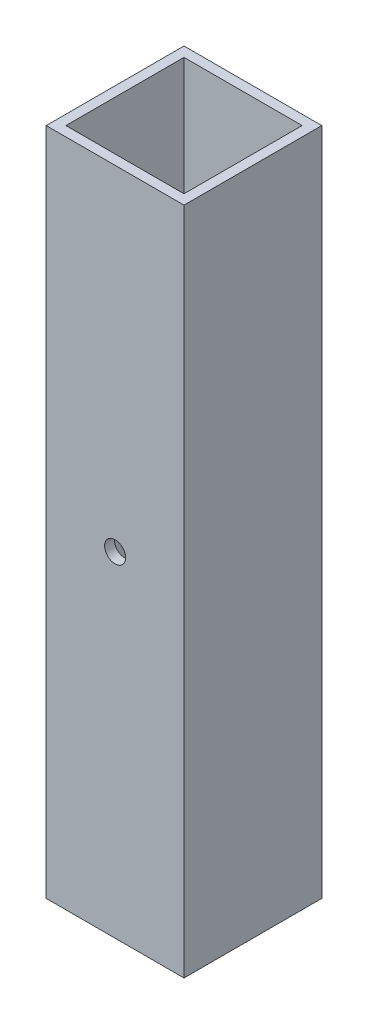
ISO-10303-21;
HEADER;
FILE_DESCRIPTION(('STEP AP214'),'2;1');
FILE_NAME('part.step','',(''),(''),'','','');
FILE_SCHEMA(('AUTOMOTIVE_DESIGN { 1 0 10303 214 1 1 1 1 }'));
ENDSEC;
DATA;
#1=APPLICATION_CONTEXT('core data for automotive mechanical design processes');
#2=APPLICATION_PROTOCOL_DEFINITION('international standard','automotive_design',2000,#1);
#3=PRODUCT_CONTEXT('',#1,'mechanical');
#4=PRODUCT('Part','Part','',(#3));
#5=PRODUCT_RELATED_PRODUCT_CATEGORY('part','',(#4));
#6=PRODUCT_DEFINITION_FORMATION('','',#4);
#7=PRODUCT_DEFINITION_CONTEXT('part definition',#1,'design');
#8=PRODUCT_DEFINITION('design','',#6,#7);
#9=PRODUCT_DEFINITION_SHAPE('','',#8);
#10=(LENGTH_UNIT() NAMED_UNIT(*) SI_UNIT(.MILLI.,.METRE.));
#11=(NAMED_UNIT(*) PLANE_ANGLE_UNIT() SI_UNIT($,.RADIAN.));
#12=(NAMED_UNIT(*) SI_UNIT($,.STERADIAN.) SOLID_ANGLE_UNIT());
#13=UNCERTAINTY_MEASURE_WITH_UNIT(LENGTH_MEASURE(1.E-05),#10,'distance_accuracy_value','');
#14=(GEOMETRIC_REPRESENTATION_CONTEXT(3) GLOBAL_UNCERTAINTY_ASSIGNED_CONTEXT((#13)) GLOBAL_UNIT_ASSIGNED_CONTEXT((#10,
#11,#12)) REPRESENTATION_CONTEXT('',''));
#15=CARTESIAN_POINT('',(0.,0.,0.));
#16=DIRECTION('',(0.,0.,1.));
#17=DIRECTION('',(1.,0.,0.));
#18=AXIS2_PLACEMENT_3D('',#15,#16,#17);
#19=CARTESIAN_POINT('',(22.225,260.35,-304.8));
#20=DIRECTION('',(0.,-1.,0.));
#21=DIRECTION('',(0.,0.,-1.));
#22=AXIS2_PLACEMENT_3D('',#19,#20,#21);
#23=PLANE('',#22);
#24=DIRECTION('',(1.,0.,0.));
#25=VECTOR('',#24,1.);
#26=CARTESIAN_POINT('',(22.225,260.35,-260.35));
#27=LINE('',#26,#25);
#28=CARTESIAN_POINT('',(0.,260.35,-260.35));
#29=VERTEX_POINT('',#28);
#30=CARTESIAN_POINT('',(44.45,260.35,-260.35));
#31=VERTEX_POINT('',#30);
#32=EDGE_CURVE('E170',#29,#31,#27,.T.);
#33=ORIENTED_EDGE('',*,*,#32,.T.);
#34=DIRECTION('',(0.,0.,1.));
#35=VECTOR('',#34,1.);
#36=CARTESIAN_POINT('',(44.45,260.35,-304.8));
#37=LINE('',#36,#35);
#38=CARTESIAN_POINT('',(44.45,260.35,-304.8));
#39=VERTEX_POINT('',#38);
#40=EDGE_CURVE('E179',#39,#31,#37,.T.);
#41=ORIENTED_EDGE('',*,*,#40,.F.);
#42=DIRECTION('',(1.,0.,0.));
#43=VECTOR('',#42,1.);
#44=CARTESIAN_POINT('',(22.225,260.35,-304.8));
#45=LINE('',#44,#43);
#46=CARTESIAN_POINT('',(0.,260.35,-304.8));
#47=VERTEX_POINT('',#46);
#48=EDGE_CURVE('E156',#47,#39,#45,.T.);
#49=ORIENTED_EDGE('',*,*,#48,.F.);
#50=DIRECTION('',(0.,0.,1.));
#51=VECTOR('',#50,1.);
#52=CARTESIAN_POINT('',(0.,260.35,-304.8));
#53=LINE('',#52,#51);
#54=EDGE_CURVE('E26',#47,#29,#53,.T.);
#55=ORIENTED_EDGE('',*,*,#54,.T.);
#56=EDGE_LOOP('',(#33,#41,#49,#55));
#57=FACE_BOUND('',#56,.T.);
#58=DIRECTION('',(1.,0.,0.));
#59=VECTOR('',#58,1.);
#60=CARTESIAN_POINT('',(22.225,260.35,-263.525));
#61=LINE('',#60,#59);
#62=CARTESIAN_POINT('',(3.175,260.35,-263.525));
#63=VERTEX_POINT('',#62);
#64=CARTESIAN_POINT('',(41.275,260.35,-263.525));
#65=VERTEX_POINT('',#64);
#66=EDGE_CURVE('E107',#63,#65,#61,.T.);
#67=ORIENTED_EDGE('',*,*,#66,.F.);
#68=DIRECTION('',(0.,0.,1.));
#69=VECTOR('',#68,1.);
#70=CARTESIAN_POINT('',(3.175,260.35,-304.8));
#71=LINE('',#70,#69);
#72=CARTESIAN_POINT('',(3.175,260.35,-301.625));
#73=VERTEX_POINT('',#72);
#74=EDGE_CURVE('E116',#73,#63,#71,.T.);
#75=ORIENTED_EDGE('',*,*,#74,.F.);
#76=DIRECTION('',(1.,0.,0.));
#77=VECTOR('',#76,1.);
#78=CARTESIAN_POINT('',(22.225,260.35,-301.625));
#79=LINE('',#78,#77);
#80=CARTESIAN_POINT('',(41.275,260.35,-301.625));
#81=VERTEX_POINT('',#80);
#82=EDGE_CURVE('E38',#73,#81,#79,.T.);
#83=ORIENTED_EDGE('',*,*,#82,.T.);
#84=DIRECTION('',(0.,0.,1.));
#85=VECTOR('',#84,1.);
#86=CARTESIAN_POINT('',(41.275,260.35,-304.8));
#87=LINE('',#86,#85);
#88=EDGE_CURVE('E122',#81,#65,#87,.T.);
#89=ORIENTED_EDGE('',*,*,#88,.T.);
#90=EDGE_LOOP('',(#67,#75,#83,#89));
#91=FACE_BOUND('',#90,.T.);
#92=ADVANCED_FACE('F16',(#57,#91),#23,.F.);
#93=CARTESIAN_POINT('',(22.225,44.45,-304.8));
#94=DIRECTION('',(0.,-1.,0.));
#95=DIRECTION('',(0.,0.,-1.));
#96=AXIS2_PLACEMENT_3D('',#93,#94,#95);
#97=PLANE('',#96);
#98=DIRECTION('',(1.,0.,0.));
#99=VECTOR('',#98,1.);
#100=CARTESIAN_POINT('',(22.225,44.45,-260.35));
#101=LINE('',#100,#99);
#102=CARTESIAN_POINT('',(0.,44.45,-260.35));
#103=VERTEX_POINT('',#102);
#104=CARTESIAN_POINT('',(44.45,44.45,-260.35));
#105=VERTEX_POINT('',#104);
#106=EDGE_CURVE('E141',#103,#105,#101,.T.);
#107=ORIENTED_EDGE('',*,*,#106,.F.);
#108=DIRECTION('',(0.,0.,1.));
#109=VECTOR('',#108,1.);
#110=CARTESIAN_POINT('',(0.,44.45,-304.8));
#111=LINE('',#110,#109);
#112=CARTESIAN_POINT('',(0.,44.45,-304.8));
#113=VERTEX_POINT('',#112);
#114=EDGE_CURVE('E11',#113,#103,#111,.T.);
#115=ORIENTED_EDGE('',*,*,#114,.F.);
#116=DIRECTION('',(1.,0.,0.));
#117=VECTOR('',#116,1.);
#118=CARTESIAN_POINT('',(22.225,44.45,-304.8));
#119=LINE('',#118,#117);
#120=CARTESIAN_POINT('',(44.45,44.45,-304.8));
#121=VERTEX_POINT('',#120);
#122=EDGE_CURVE('E148',#113,#121,#119,.T.);
#123=ORIENTED_EDGE('',*,*,#122,.T.);
#124=DIRECTION('',(0.,0.,1.));
#125=VECTOR('',#124,1.);
#126=CARTESIAN_POINT('',(44.45,44.45,-304.8));
#127=LINE('',#126,#125);
#128=EDGE_CURVE('E163',#121,#105,#127,.T.);
#129=ORIENTED_EDGE('',*,*,#128,.T.);
#130=EDGE_LOOP('',(#107,#115,#123,#129));
#131=FACE_BOUND('',#130,.T.);
#132=DIRECTION('',(0.,0.,1.));
#133=VECTOR('',#132,1.);
#134=CARTESIAN_POINT('',(3.175,44.45,-304.8));
#135=LINE('',#134,#133);
#136=CARTESIAN_POINT('',(3.175,44.45,-301.625));
#137=VERTEX_POINT('',#136);
#138=CARTESIAN_POINT('',(3.175,44.45,-263.525));
#139=VERTEX_POINT('',#138);
#140=EDGE_CURVE('E121',#137,#139,#135,.T.);
#141=ORIENTED_EDGE('',*,*,#140,.T.);
#142=DIRECTION('',(1.,0.,0.));
#143=VECTOR('',#142,1.);
#144=CARTESIAN_POINT('',(22.225,44.45,-263.525));
#145=LINE('',#144,#143);
#146=CARTESIAN_POINT('',(41.275,44.45,-263.525));
#147=VERTEX_POINT('',#146);
#148=EDGE_CURVE('E110',#139,#147,#145,.T.);
#149=ORIENTED_EDGE('',*,*,#148,.T.);
#150=DIRECTION('',(0.,0.,1.));
#151=VECTOR('',#150,1.);
#152=CARTESIAN_POINT('',(41.275,44.45,-304.8));
#153=LINE('',#152,#151);
#154=CARTESIAN_POINT('',(41.275,44.45,-301.625));
#155=VERTEX_POINT('',#154);
#156=EDGE_CURVE('E137',#155,#147,#153,.T.);
#157=ORIENTED_EDGE('',*,*,#156,.F.);
#158=DIRECTION('',(1.,0.,0.));
#159=VECTOR('',#158,1.);
#160=CARTESIAN_POINT('',(22.225,44.45,-301.625));
#161=LINE('',#160,#159);
#162=EDGE_CURVE('E132',#137,#155,#161,.T.);
#163=ORIENTED_EDGE('',*,*,#162,.F.);
#164=EDGE_LOOP('',(#141,#149,#157,#163));
#165=FACE_BOUND('',#164,.T.);
#166=ADVANCED_FACE('F18',(#131,#165),#97,.T.);
#167=CARTESIAN_POINT('',(0.,152.4,-304.8));
#168=DIRECTION('',(1.,0.,0.));
#169=DIRECTION('',(0.,0.,-1.));
#170=AXIS2_PLACEMENT_3D('',#167,#168,#169);
#171=PLANE('',#170);
#172=DIRECTION('',(0.,1.,0.));
#173=VECTOR('',#172,1.);
#174=CARTESIAN_POINT('',(0.,152.4,-260.35));
#175=LINE('',#174,#173);
#176=EDGE_CURVE('E167',#103,#29,#175,.T.);
#177=ORIENTED_EDGE('',*,*,#176,.T.);
#178=ORIENTED_EDGE('',*,*,#54,.F.);
#179=DIRECTION('',(0.,1.,0.));
#180=VECTOR('',#179,1.);
#181=CARTESIAN_POINT('',(0.,152.4,-304.8));
#182=LINE('',#181,#180);
#183=EDGE_CURVE('E152',#113,#47,#182,.T.);
#184=ORIENTED_EDGE('',*,*,#183,.F.);
#185=ORIENTED_EDGE('',*,*,#114,.T.);
#186=EDGE_LOOP('',(#177,#178,#184,#185));
#187=FACE_BOUND('',#186,.T.);
#188=ADVANCED_FACE('F203',(#187),#171,.F.);
#189=CARTESIAN_POINT('',(44.45,152.4,-304.8));
#190=DIRECTION('',(1.,0.,0.));
#191=DIRECTION('',(0.,0.,-1.));
#192=AXIS2_PLACEMENT_3D('',#189,#190,#191);
#193=PLANE('',#192);
#194=DIRECTION('',(0.,1.,0.));
#195=VECTOR('',#194,1.);
#196=CARTESIAN_POINT('',(44.45,152.4,-260.35));
#197=LINE('',#196,#195);
#198=EDGE_CURVE('E153',#105,#31,#197,.T.);
#199=ORIENTED_EDGE('',*,*,#198,.F.);
#200=ORIENTED_EDGE('',*,*,#128,.F.);
#201=DIRECTION('',(0.,1.,0.));
#202=VECTOR('',#201,1.);
#203=CARTESIAN_POINT('',(44.45,152.4,-304.8));
#204=LINE('',#203,#202);
#205=EDGE_CURVE('E159',#121,#39,#204,.T.);
#206=ORIENTED_EDGE('',*,*,#205,.T.);
#207=ORIENTED_EDGE('',*,*,#40,.T.);
#208=EDGE_LOOP('',(#199,#200,#206,#207));
#209=FACE_BOUND('',#208,.T.);
#210=ADVANCED_FACE('F198',(#209),#193,.T.);
#211=CARTESIAN_POINT('',(22.225,152.4,-304.8));
#212=DIRECTION('',(0.,0.,-1.));
#213=DIRECTION('',(1.,0.,0.));
#214=AXIS2_PLACEMENT_3D('',#211,#212,#213);
#215=PLANE('',#214);
#216=CARTESIAN_POINT('',(22.225,152.4,-304.8));
#217=DIRECTION('',(0.,0.,-1.));
#218=DIRECTION('',(-1.,0.,0.));
#219=AXIS2_PLACEMENT_3D('',#216,#217,#218);
#220=CIRCLE('',#219,3.3782);
#221=CARTESIAN_POINT('',(18.8468,152.4,-304.8));
#222=VERTEX_POINT('',#221);
#223=EDGE_CURVE('E147',#222,#222,#220,.F.);
#224=ORIENTED_EDGE('',*,*,#223,.T.);
#225=EDGE_LOOP('',(#224));
#226=FACE_BOUND('',#225,.T.);
#227=ORIENTED_EDGE('',*,*,#122,.F.);
#228=ORIENTED_EDGE('',*,*,#183,.T.);
#229=ORIENTED_EDGE('',*,*,#48,.T.);
#230=ORIENTED_EDGE('',*,*,#205,.F.);
#231=EDGE_LOOP('',(#227,#228,#229,#230));
#232=FACE_BOUND('',#231,.T.);
#233=ADVANCED_FACE('F202',(#226,#232),#215,.T.);
#234=CARTESIAN_POINT('',(22.225,152.4,-260.35));
#235=DIRECTION('',(0.,0.,-1.));
#236=DIRECTION('',(1.,0.,0.));
#237=AXIS2_PLACEMENT_3D('',#234,#235,#236);
#238=PLANE('',#237);
#239=CARTESIAN_POINT('',(22.225,152.4,-260.35));
#240=DIRECTION('',(0.,0.,1.));
#241=DIRECTION('',(1.,0.,0.));
#242=AXIS2_PLACEMENT_3D('',#239,#240,#241);
#243=CIRCLE('',#242,3.3782);
#244=CARTESIAN_POINT('',(25.6032,152.4,-260.35));
#245=VERTEX_POINT('',#244);
#246=EDGE_CURVE('E256',#245,#245,#243,.T.);
#247=ORIENTED_EDGE('',*,*,#246,.F.);
#248=EDGE_LOOP('',(#247));
#249=FACE_BOUND('',#248,.T.);
#250=ORIENTED_EDGE('',*,*,#106,.T.);
#251=ORIENTED_EDGE('',*,*,#198,.T.);
#252=ORIENTED_EDGE('',*,*,#32,.F.);
#253=ORIENTED_EDGE('',*,*,#176,.F.);
#254=EDGE_LOOP('',(#250,#251,#252,#253));
#255=FACE_BOUND('',#254,.T.);
#256=ADVANCED_FACE('F194',(#249,#255),#238,.F.);
#257=CARTESIAN_POINT('',(3.175,152.4,-304.8));
#258=DIRECTION('',(1.,0.,0.));
#259=DIRECTION('',(0.,0.,-1.));
#260=AXIS2_PLACEMENT_3D('',#257,#258,#259);
#261=PLANE('',#260);
#262=DIRECTION('',(0.,1.,0.));
#263=VECTOR('',#262,1.);
#264=CARTESIAN_POINT('',(3.175,152.4,-263.525));
#265=LINE('',#264,#263);
#266=EDGE_CURVE('E102',#139,#63,#265,.T.);
#267=ORIENTED_EDGE('',*,*,#266,.F.);
#268=ORIENTED_EDGE('',*,*,#140,.F.);
#269=DIRECTION('',(0.,1.,0.));
#270=VECTOR('',#269,1.);
#271=CARTESIAN_POINT('',(3.175,152.4,-301.625));
#272=LINE('',#271,#270);
#273=EDGE_CURVE('E118',#137,#73,#272,.T.);
#274=ORIENTED_EDGE('',*,*,#273,.T.);
#275=ORIENTED_EDGE('',*,*,#74,.T.);
#276=EDGE_LOOP('',(#267,#268,#274,#275));
#277=FACE_BOUND('',#276,.T.);
#278=ADVANCED_FACE('F117',(#277),#261,.T.);
#279=CARTESIAN_POINT('',(41.275,152.4,-304.8));
#280=DIRECTION('',(1.,0.,0.));
#281=DIRECTION('',(0.,0.,-1.));
#282=AXIS2_PLACEMENT_3D('',#279,#280,#281);
#283=PLANE('',#282);
#284=DIRECTION('',(0.,1.,0.));
#285=VECTOR('',#284,1.);
#286=CARTESIAN_POINT('',(41.275,152.4,-263.525));
#287=LINE('',#286,#285);
#288=EDGE_CURVE('E126',#147,#65,#287,.T.);
#289=ORIENTED_EDGE('',*,*,#288,.T.);
#290=ORIENTED_EDGE('',*,*,#88,.F.);
#291=DIRECTION('',(0.,1.,0.));
#292=VECTOR('',#291,1.);
#293=CARTESIAN_POINT('',(41.275,152.4,-301.625));
#294=LINE('',#293,#292);
#295=EDGE_CURVE('E48',#155,#81,#294,.T.);
#296=ORIENTED_EDGE('',*,*,#295,.F.);
#297=ORIENTED_EDGE('',*,*,#156,.T.);
#298=EDGE_LOOP('',(#289,#290,#296,#297));
#299=FACE_BOUND('',#298,.T.);
#300=ADVANCED_FACE('F225',(#299),#283,.F.);
#301=CARTESIAN_POINT('',(22.225,152.4,-301.625));
#302=DIRECTION('',(0.,0.,-1.));
#303=DIRECTION('',(1.,0.,0.));
#304=AXIS2_PLACEMENT_3D('',#301,#302,#303);
#305=PLANE('',#304);
#306=CARTESIAN_POINT('',(22.225,152.4,-301.625));
#307=DIRECTION('',(0.,0.,-1.));
#308=DIRECTION('',(-1.,0.,0.));
#309=AXIS2_PLACEMENT_3D('',#306,#307,#308);
#310=CIRCLE('',#309,3.3782);
#311=CARTESIAN_POINT('',(18.8468,152.4,-301.625));
#312=VERTEX_POINT('',#311);
#313=EDGE_CURVE('E301',#312,#312,#310,.F.);
#314=ORIENTED_EDGE('',*,*,#313,.F.);
#315=EDGE_LOOP('',(#314));
#316=FACE_BOUND('',#315,.T.);
#317=ORIENTED_EDGE('',*,*,#162,.T.);
#318=ORIENTED_EDGE('',*,*,#295,.T.);
#319=ORIENTED_EDGE('',*,*,#82,.F.);
#320=ORIENTED_EDGE('',*,*,#273,.F.);
#321=EDGE_LOOP('',(#317,#318,#319,#320));
#322=FACE_BOUND('',#321,.T.);
#323=ADVANCED_FACE('F209',(#316,#322),#305,.F.);
#324=CARTESIAN_POINT('',(22.225,152.4,-263.525));
#325=DIRECTION('',(0.,0.,-1.));
#326=DIRECTION('',(1.,0.,0.));
#327=AXIS2_PLACEMENT_3D('',#324,#325,#326);
#328=PLANE('',#327);
#329=CARTESIAN_POINT('',(22.225,152.4,-263.525));
#330=DIRECTION('',(0.,0.,-1.));
#331=DIRECTION('',(-1.,0.,0.));
#332=AXIS2_PLACEMENT_3D('',#329,#330,#331);
#333=CIRCLE('',#332,3.3782);
#334=CARTESIAN_POINT('',(18.8468,152.4,-263.525));
#335=VERTEX_POINT('',#334);
#336=EDGE_CURVE('E20',#335,#335,#333,.F.);
#337=ORIENTED_EDGE('',*,*,#336,.T.);
#338=EDGE_LOOP('',(#337));
#339=FACE_BOUND('',#338,.T.);
#340=ORIENTED_EDGE('',*,*,#148,.F.);
#341=ORIENTED_EDGE('',*,*,#266,.T.);
#342=ORIENTED_EDGE('',*,*,#66,.T.);
#343=ORIENTED_EDGE('',*,*,#288,.F.);
#344=EDGE_LOOP('',(#340,#341,#342,#343));
#345=FACE_BOUND('',#344,.T.);
#346=ADVANCED_FACE('F104',(#339,#345),#328,.T.);
#347=CARTESIAN_POINT('',(22.225,152.4,-486.230240033847));
#348=DIRECTION('',(0.,0.,1.));
#349=DIRECTION('',(1.,0.,0.));
#350=AXIS2_PLACEMENT_3D('',#347,#348,#349);
#351=CYLINDRICAL_SURFACE('',#350,3.3782);
#352=ORIENTED_EDGE('',*,*,#336,.F.);
#353=EDGE_LOOP('',(#352));
#354=FACE_BOUND('',#353,.T.);
#355=ORIENTED_EDGE('',*,*,#246,.T.);
#356=EDGE_LOOP('',(#355));
#357=FACE_BOUND('',#356,.T.);
#358=ADVANCED_FACE('F283',(#354,#357),#351,.F.);
#359=ORIENTED_EDGE('',*,*,#223,.F.);
#360=EDGE_LOOP('',(#359));
#361=FACE_BOUND('',#360,.T.);
#362=ORIENTED_EDGE('',*,*,#313,.T.);
#363=EDGE_LOOP('',(#362));
#364=FACE_BOUND('',#363,.T.);
#365=ADVANCED_FACE('F312',(#361,#364),#351,.F.);
#366=CLOSED_SHELL('',(#92,#166,#188,#210,#233,#256,#278,#300,#323,#346,#358,#365));
#367=MANIFOLD_SOLID_BREP('B1',#366);
#368=ADVANCED_BREP_SHAPE_REPRESENTATION('',(#18,#367),#14);
#369=SHAPE_DEFINITION_REPRESENTATION(#9,#368);
ENDSEC;
END-ISO-10303-21;
